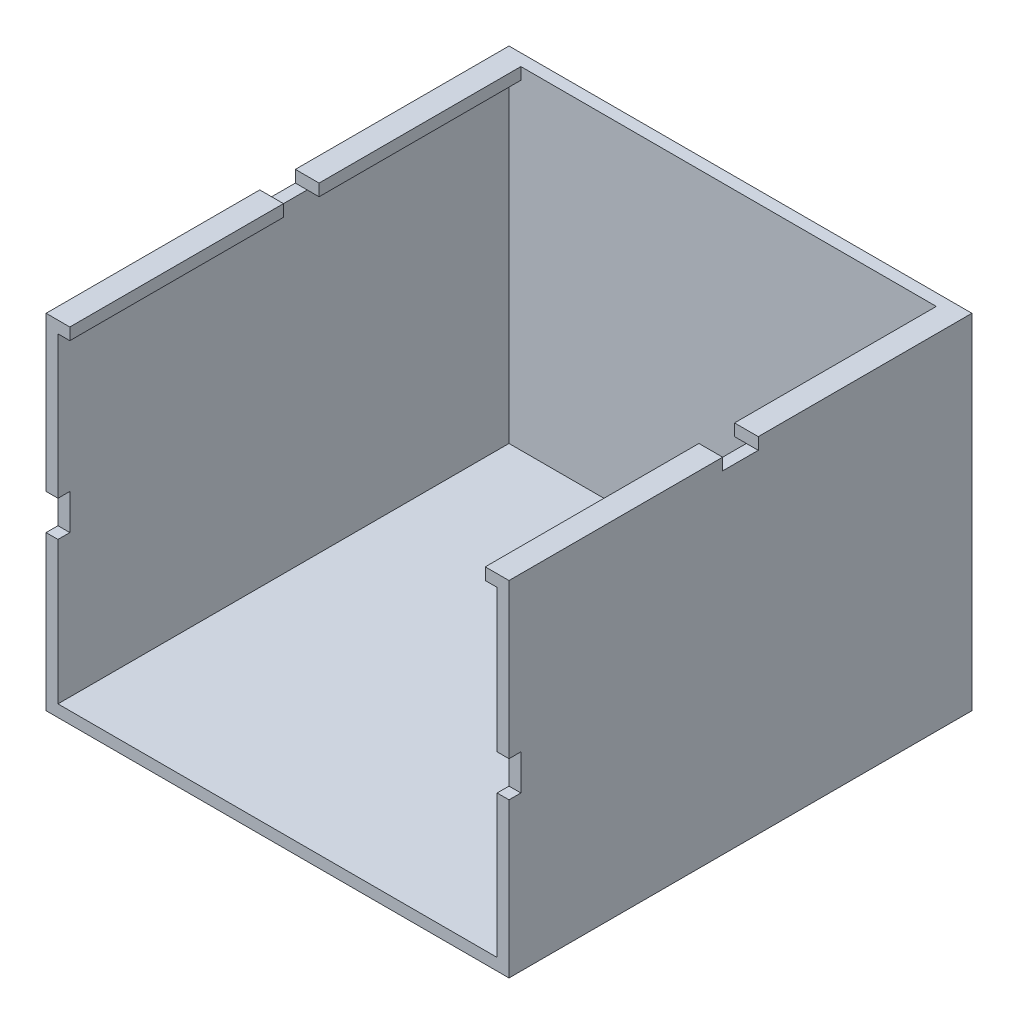
ISO-10303-21;
HEADER;
FILE_DESCRIPTION(('STEP AP214'),'2;1');
FILE_NAME('part.step','',(''),(''),'','','');
FILE_SCHEMA(('AUTOMOTIVE_DESIGN { 1 0 10303 214 1 1 1 1 }'));
ENDSEC;
DATA;
#1=APPLICATION_CONTEXT('core data for automotive mechanical design processes');
#2=APPLICATION_PROTOCOL_DEFINITION('international standard','automotive_design',2000,#1);
#3=PRODUCT_CONTEXT('',#1,'mechanical');
#4=PRODUCT('Part','Part','',(#3));
#5=PRODUCT_RELATED_PRODUCT_CATEGORY('part','',(#4));
#6=PRODUCT_DEFINITION_FORMATION('','',#4);
#7=PRODUCT_DEFINITION_CONTEXT('part definition',#1,'design');
#8=PRODUCT_DEFINITION('design','',#6,#7);
#9=PRODUCT_DEFINITION_SHAPE('','',#8);
#10=(LENGTH_UNIT() NAMED_UNIT(*) SI_UNIT(.MILLI.,.METRE.));
#11=(NAMED_UNIT(*) PLANE_ANGLE_UNIT() SI_UNIT($,.RADIAN.));
#12=(NAMED_UNIT(*) SI_UNIT($,.STERADIAN.) SOLID_ANGLE_UNIT());
#13=UNCERTAINTY_MEASURE_WITH_UNIT(LENGTH_MEASURE(1.E-05),#10,'distance_accuracy_value','');
#14=(GEOMETRIC_REPRESENTATION_CONTEXT(3) GLOBAL_UNCERTAINTY_ASSIGNED_CONTEXT((#13)) GLOBAL_UNIT_ASSIGNED_CONTEXT((#10,
#11,#12)) REPRESENTATION_CONTEXT('',''));
#15=CARTESIAN_POINT('',(0.,0.,0.));
#16=DIRECTION('',(0.,0.,1.));
#17=DIRECTION('',(1.,0.,0.));
#18=AXIS2_PLACEMENT_3D('',#15,#16,#17);
#19=CARTESIAN_POINT('',(15.4272817580175,29.,19.6975655430712));
#20=DIRECTION('',(0.,0.,-1.));
#21=DIRECTION('',(-1.,0.,0.));
#22=AXIS2_PLACEMENT_3D('',#19,#20,#21);
#23=PLANE('',#22);
#24=DIRECTION('',(0.,1.,0.));
#25=VECTOR('',#24,1.);
#26=CARTESIAN_POINT('',(14.4272817580175,28.,19.6975655430712));
#27=LINE('',#26,#25);
#28=CARTESIAN_POINT('',(14.4272817580175,16.,19.6975655430712));
#29=VERTEX_POINT('',#28);
#30=CARTESIAN_POINT('',(14.4272817580175,28.,19.6975655430712));
#31=VERTEX_POINT('',#30);
#32=EDGE_CURVE('E485',#29,#31,#27,.T.);
#33=ORIENTED_EDGE('',*,*,#32,.F.);
#34=DIRECTION('',(-1.,0.,0.));
#35=VECTOR('',#34,1.);
#36=CARTESIAN_POINT('',(-25.3047218498162,16.,19.6975655430712));
#37=LINE('',#36,#35);
#38=CARTESIAN_POINT('',(15.4272817580175,16.,19.6975655430712));
#39=VERTEX_POINT('',#38);
#40=EDGE_CURVE('E339',#39,#29,#37,.T.);
#41=ORIENTED_EDGE('',*,*,#40,.F.);
#42=DIRECTION('',(0.,-1.,0.));
#43=VECTOR('',#42,1.);
#44=CARTESIAN_POINT('',(15.4272817580175,29.,19.6975655430712));
#45=LINE('',#44,#43);
#46=CARTESIAN_POINT('',(15.4272817580175,29.,19.6975655430712));
#47=VERTEX_POINT('',#46);
#48=EDGE_CURVE('E291',#47,#39,#45,.T.);
#49=ORIENTED_EDGE('',*,*,#48,.F.);
#50=DIRECTION('',(1.,0.,0.));
#51=VECTOR('',#50,1.);
#52=CARTESIAN_POINT('',(15.4272817580175,29.,19.6975655430712));
#53=LINE('',#52,#51);
#54=CARTESIAN_POINT('',(13.4272817580175,29.,19.6975655430712));
#55=VERTEX_POINT('',#54);
#56=EDGE_CURVE('E522',#55,#47,#53,.T.);
#57=ORIENTED_EDGE('',*,*,#56,.F.);
#58=DIRECTION('',(0.,-1.,0.));
#59=VECTOR('',#58,1.);
#60=CARTESIAN_POINT('',(13.4272817580175,29.,19.6975655430712));
#61=LINE('',#60,#59);
#62=CARTESIAN_POINT('',(13.4272817580175,28.,19.6975655430712));
#63=VERTEX_POINT('',#62);
#64=EDGE_CURVE('E445',#55,#63,#61,.T.);
#65=ORIENTED_EDGE('',*,*,#64,.T.);
#66=DIRECTION('',(-1.,0.,0.));
#67=VECTOR('',#66,1.);
#68=CARTESIAN_POINT('',(-22.5727182419825,28.,19.6975655430712));
#69=LINE('',#68,#67);
#70=EDGE_CURVE('E463',#31,#63,#69,.T.);
#71=ORIENTED_EDGE('',*,*,#70,.F.);
#72=EDGE_LOOP('',(#33,#41,#49,#57,#65,#71));
#73=FACE_BOUND('',#72,.T.);
#74=ADVANCED_FACE('F62',(#73),#23,.F.);
#75=DIRECTION('',(0.,-1.,0.));
#76=VECTOR('',#75,1.);
#77=CARTESIAN_POINT('',(-23.5727182419825,29.,19.6975655430712));
#78=LINE('',#77,#76);
#79=CARTESIAN_POINT('',(-23.5727182419825,29.,19.6975655430712));
#80=VERTEX_POINT('',#79);
#81=CARTESIAN_POINT('',(-23.5727182419825,16.,19.6975655430712));
#82=VERTEX_POINT('',#81);
#83=EDGE_CURVE('E290',#80,#82,#78,.T.);
#84=ORIENTED_EDGE('',*,*,#83,.T.);
#85=CARTESIAN_POINT('',(-22.5727182419825,16.,19.6975655430712));
#86=VERTEX_POINT('',#85);
#87=EDGE_CURVE('E281',#86,#82,#37,.T.);
#88=ORIENTED_EDGE('',*,*,#87,.F.);
#89=DIRECTION('',(0.,-1.,0.));
#90=VECTOR('',#89,1.);
#91=CARTESIAN_POINT('',(-22.5727182419825,28.,19.6975655430712));
#92=LINE('',#91,#90);
#93=CARTESIAN_POINT('',(-22.5727182419825,28.,19.6975655430712));
#94=VERTEX_POINT('',#93);
#95=EDGE_CURVE('E477',#94,#86,#92,.T.);
#96=ORIENTED_EDGE('',*,*,#95,.F.);
#97=CARTESIAN_POINT('',(-21.5727182419825,28.,19.6975655430712));
#98=VERTEX_POINT('',#97);
#99=EDGE_CURVE('E488',#98,#94,#69,.T.);
#100=ORIENTED_EDGE('',*,*,#99,.F.);
#101=DIRECTION('',(0.,1.,0.));
#102=VECTOR('',#101,1.);
#103=CARTESIAN_POINT('',(-21.5727182419825,29.,19.6975655430712));
#104=LINE('',#103,#102);
#105=CARTESIAN_POINT('',(-21.5727182419825,29.,19.6975655430712));
#106=VERTEX_POINT('',#105);
#107=EDGE_CURVE('E454',#98,#106,#104,.T.);
#108=ORIENTED_EDGE('',*,*,#107,.T.);
#109=EDGE_CURVE('E523',#80,#106,#53,.T.);
#110=ORIENTED_EDGE('',*,*,#109,.F.);
#111=EDGE_LOOP('',(#84,#88,#96,#100,#108,#110));
#112=FACE_BOUND('',#111,.T.);
#113=ADVANCED_FACE('F640',(#112),#23,.F.);
#114=CARTESIAN_POINT('',(-22.5727182419825,28.,-18.3024344569288));
#115=DIRECTION('',(0.,1.,0.));
#116=DIRECTION('',(0.,0.,1.));
#117=AXIS2_PLACEMENT_3D('',#114,#115,#116);
#118=PLANE('',#117);
#119=DIRECTION('',(1.,0.,0.));
#120=VECTOR('',#119,1.);
#121=CARTESIAN_POINT('',(0.,28.,1.69756554307116));
#122=LINE('',#121,#120);
#123=CARTESIAN_POINT('',(-22.5727182419825,28.,1.69756554307116));
#124=VERTEX_POINT('',#123);
#125=CARTESIAN_POINT('',(-21.5727182419825,28.,1.69756554307116));
#126=VERTEX_POINT('',#125);
#127=EDGE_CURVE('E579',#124,#126,#122,.T.);
#128=ORIENTED_EDGE('',*,*,#127,.T.);
#129=DIRECTION('',(0.,0.,1.));
#130=VECTOR('',#129,1.);
#131=CARTESIAN_POINT('',(-21.5727182419825,28.,-18.3024344569288));
#132=LINE('',#131,#130);
#133=EDGE_CURVE('E449',#126,#98,#132,.T.);
#134=ORIENTED_EDGE('',*,*,#133,.T.);
#135=ORIENTED_EDGE('',*,*,#99,.T.);
#136=DIRECTION('',(0.,0.,1.));
#137=VECTOR('',#136,1.);
#138=CARTESIAN_POINT('',(-22.5727182419825,28.,-18.3024344569288));
#139=LINE('',#138,#137);
#140=EDGE_CURVE('E497',#124,#94,#139,.T.);
#141=ORIENTED_EDGE('',*,*,#140,.F.);
#142=EDGE_LOOP('',(#128,#134,#135,#141));
#143=FACE_BOUND('',#142,.T.);
#144=ADVANCED_FACE('F654',(#143),#118,.F.);
#145=CARTESIAN_POINT('',(0.,29.,0.));
#146=DIRECTION('',(0.,1.,0.));
#147=DIRECTION('',(0.,0.,1.));
#148=AXIS2_PLACEMENT_3D('',#145,#146,#147);
#149=PLANE('',#148);
#150=DIRECTION('',(0.,0.,-1.));
#151=VECTOR('',#150,1.);
#152=CARTESIAN_POINT('',(15.4272817580175,29.,19.6975655430712));
#153=LINE('',#152,#151);
#154=CARTESIAN_POINT('',(15.4272817580175,29.,1.69756554307116));
#155=VERTEX_POINT('',#154);
#156=EDGE_CURVE('E509',#47,#155,#153,.T.);
#157=ORIENTED_EDGE('',*,*,#156,.T.);
#158=DIRECTION('',(-1.,0.,0.));
#159=VECTOR('',#158,1.);
#160=CARTESIAN_POINT('',(0.,29.,1.69756554307116));
#161=LINE('',#160,#159);
#162=CARTESIAN_POINT('',(13.4272817580175,29.,1.69756554307116));
#163=VERTEX_POINT('',#162);
#164=EDGE_CURVE('E377',#155,#163,#161,.T.);
#165=ORIENTED_EDGE('',*,*,#164,.T.);
#166=DIRECTION('',(0.,0.,-1.));
#167=VECTOR('',#166,1.);
#168=CARTESIAN_POINT('',(13.4272817580175,29.,-18.3024344569288));
#169=LINE('',#168,#167);
#170=EDGE_CURVE('E425',#55,#163,#169,.T.);
#171=ORIENTED_EDGE('',*,*,#170,.F.);
#172=ORIENTED_EDGE('',*,*,#56,.T.);
#173=EDGE_LOOP('',(#157,#165,#171,#172));
#174=FACE_BOUND('',#173,.T.);
#175=ADVANCED_FACE('F694',(#174),#149,.T.);
#176=DIRECTION('',(0.,0.,1.));
#177=VECTOR('',#176,1.);
#178=CARTESIAN_POINT('',(-21.5727182419825,29.,-18.3024344569288));
#179=LINE('',#178,#177);
#180=CARTESIAN_POINT('',(-21.5727182419825,29.,1.69756554307116));
#181=VERTEX_POINT('',#180);
#182=EDGE_CURVE('E419',#181,#106,#179,.T.);
#183=ORIENTED_EDGE('',*,*,#182,.F.);
#184=CARTESIAN_POINT('',(-23.5727182419825,29.,1.69756554307116));
#185=VERTEX_POINT('',#184);
#186=EDGE_CURVE('E382',#181,#185,#161,.T.);
#187=ORIENTED_EDGE('',*,*,#186,.T.);
#188=DIRECTION('',(0.,0.,1.));
#189=VECTOR('',#188,1.);
#190=CARTESIAN_POINT('',(-23.5727182419825,29.,19.6975655430712));
#191=LINE('',#190,#189);
#192=EDGE_CURVE('E517',#185,#80,#191,.T.);
#193=ORIENTED_EDGE('',*,*,#192,.T.);
#194=ORIENTED_EDGE('',*,*,#109,.T.);
#195=EDGE_LOOP('',(#183,#187,#193,#194));
#196=FACE_BOUND('',#195,.T.);
#197=ADVANCED_FACE('F635',(#196),#149,.T.);
#198=CARTESIAN_POINT('',(13.4272817580175,28.,1.69756554307116));
#199=VERTEX_POINT('',#198);
#200=CARTESIAN_POINT('',(14.4272817580175,28.,1.69756554307116));
#201=VERTEX_POINT('',#200);
#202=EDGE_CURVE('E369',#199,#201,#122,.T.);
#203=ORIENTED_EDGE('',*,*,#202,.T.);
#204=DIRECTION('',(0.,0.,1.));
#205=VECTOR('',#204,1.);
#206=CARTESIAN_POINT('',(14.4272817580175,28.,-18.3024344569288));
#207=LINE('',#206,#205);
#208=EDGE_CURVE('E502',#201,#31,#207,.T.);
#209=ORIENTED_EDGE('',*,*,#208,.T.);
#210=ORIENTED_EDGE('',*,*,#70,.T.);
#211=DIRECTION('',(0.,0.,-1.));
#212=VECTOR('',#211,1.);
#213=CARTESIAN_POINT('',(13.4272817580175,28.,-18.3024344569288));
#214=LINE('',#213,#212);
#215=EDGE_CURVE('E441',#63,#199,#214,.T.);
#216=ORIENTED_EDGE('',*,*,#215,.T.);
#217=EDGE_LOOP('',(#203,#209,#210,#216));
#218=FACE_BOUND('',#217,.T.);
#219=ADVANCED_FACE('F621',(#218),#118,.F.);
#220=CARTESIAN_POINT('',(-21.5727182419825,19.,-18.3024344569288));
#221=DIRECTION('',(-1.,0.,0.));
#222=DIRECTION('',(0.,0.,1.));
#223=AXIS2_PLACEMENT_3D('',#220,#221,#222);
#224=PLANE('',#223);
#225=DIRECTION('',(0.,-1.,0.));
#226=VECTOR('',#225,1.);
#227=CARTESIAN_POINT('',(-21.5727182419825,19.,1.69756554307116));
#228=LINE('',#227,#226);
#229=EDGE_CURVE('E385',#181,#126,#228,.T.);
#230=ORIENTED_EDGE('',*,*,#229,.F.);
#231=ORIENTED_EDGE('',*,*,#182,.T.);
#232=ORIENTED_EDGE('',*,*,#107,.F.);
#233=ORIENTED_EDGE('',*,*,#133,.F.);
#234=EDGE_LOOP('',(#230,#231,#232,#233));
#235=FACE_BOUND('',#234,.T.);
#236=ADVANCED_FACE('F648',(#235),#224,.F.);
#237=CARTESIAN_POINT('',(13.4272817580175,19.,-18.3024344569288));
#238=DIRECTION('',(1.,0.,0.));
#239=DIRECTION('',(0.,0.,-1.));
#240=AXIS2_PLACEMENT_3D('',#237,#238,#239);
#241=PLANE('',#240);
#242=DIRECTION('',(0.,1.,0.));
#243=VECTOR('',#242,1.);
#244=CARTESIAN_POINT('',(13.4272817580175,19.,1.69756554307116));
#245=LINE('',#244,#243);
#246=EDGE_CURVE('E308',#199,#163,#245,.T.);
#247=ORIENTED_EDGE('',*,*,#246,.F.);
#248=ORIENTED_EDGE('',*,*,#215,.F.);
#249=ORIENTED_EDGE('',*,*,#64,.F.);
#250=ORIENTED_EDGE('',*,*,#170,.T.);
#251=EDGE_LOOP('',(#247,#248,#249,#250));
#252=FACE_BOUND('',#251,.T.);
#253=ADVANCED_FACE('F623',(#252),#241,.F.);
#254=CARTESIAN_POINT('',(-21.5727182419825,28.,-18.3024344569288));
#255=VERTEX_POINT('',#254);
#256=CARTESIAN_POINT('',(-21.5727182419825,28.,-1.30243445692884));
#257=VERTEX_POINT('',#256);
#258=EDGE_CURVE('E450',#255,#257,#132,.T.);
#259=ORIENTED_EDGE('',*,*,#258,.T.);
#260=DIRECTION('',(1.,0.,0.));
#261=VECTOR('',#260,1.);
#262=CARTESIAN_POINT('',(0.,28.,-1.30243445692884));
#263=LINE('',#262,#261);
#264=CARTESIAN_POINT('',(-22.5727182419825,28.,-1.30243445692884));
#265=VERTEX_POINT('',#264);
#266=EDGE_CURVE('E573',#265,#257,#263,.T.);
#267=ORIENTED_EDGE('',*,*,#266,.F.);
#268=CARTESIAN_POINT('',(-22.5727182419825,28.,-18.3024344569288));
#269=VERTEX_POINT('',#268);
#270=EDGE_CURVE('E492',#269,#265,#139,.T.);
#271=ORIENTED_EDGE('',*,*,#270,.F.);
#272=DIRECTION('',(-1.,0.,0.));
#273=VECTOR('',#272,1.);
#274=CARTESIAN_POINT('',(-22.5727182419825,28.,-18.3024344569288));
#275=LINE('',#274,#273);
#276=EDGE_CURVE('E471',#255,#269,#275,.T.);
#277=ORIENTED_EDGE('',*,*,#276,.F.);
#278=EDGE_LOOP('',(#259,#267,#271,#277));
#279=FACE_BOUND('',#278,.T.);
#280=ADVANCED_FACE('F667',(#279),#118,.F.);
#281=CARTESIAN_POINT('',(15.4272817580175,29.,19.6975655430712));
#282=DIRECTION('',(-1.,0.,0.));
#283=DIRECTION('',(0.,0.,1.));
#284=AXIS2_PLACEMENT_3D('',#281,#282,#283);
#285=PLANE('',#284);
#286=ORIENTED_EDGE('',*,*,#48,.T.);
#287=DIRECTION('',(0.,0.,-1.));
#288=VECTOR('',#287,1.);
#289=CARTESIAN_POINT('',(15.4272817580175,16.,19.6975655430712));
#290=LINE('',#289,#288);
#291=CARTESIAN_POINT('',(15.4272817580175,16.,18.6975655430712));
#292=VERTEX_POINT('',#291);
#293=EDGE_CURVE('E361',#39,#292,#290,.T.);
#294=ORIENTED_EDGE('',*,*,#293,.T.);
#295=DIRECTION('',(0.,1.,0.));
#296=VECTOR('',#295,1.);
#297=CARTESIAN_POINT('',(15.4272817580175,29.,18.6975655430712));
#298=LINE('',#297,#296);
#299=CARTESIAN_POINT('',(15.4272817580175,13.,18.6975655430712));
#300=VERTEX_POINT('',#299);
#301=EDGE_CURVE('E346',#300,#292,#298,.T.);
#302=ORIENTED_EDGE('',*,*,#301,.F.);
#303=DIRECTION('',(0.,0.,1.));
#304=VECTOR('',#303,1.);
#305=CARTESIAN_POINT('',(15.4272817580175,13.,19.6975655430712));
#306=LINE('',#305,#304);
#307=CARTESIAN_POINT('',(15.4272817580175,13.,19.6975655430712));
#308=VERTEX_POINT('',#307);
#309=EDGE_CURVE('E268',#300,#308,#306,.T.);
#310=ORIENTED_EDGE('',*,*,#309,.T.);
#311=CARTESIAN_POINT('',(15.4272817580175,0.,19.6975655430712));
#312=VERTEX_POINT('',#311);
#313=EDGE_CURVE('E298',#308,#312,#45,.T.);
#314=ORIENTED_EDGE('',*,*,#313,.T.);
#315=DIRECTION('',(0.,0.,-1.));
#316=VECTOR('',#315,1.);
#317=CARTESIAN_POINT('',(15.4272817580175,0.,19.6975655430712));
#318=LINE('',#317,#316);
#319=CARTESIAN_POINT('',(15.4272817580175,0.,-19.3024344569288));
#320=VERTEX_POINT('',#319);
#321=EDGE_CURVE('E496',#312,#320,#318,.T.);
#322=ORIENTED_EDGE('',*,*,#321,.T.);
#323=DIRECTION('',(0.,-1.,0.));
#324=VECTOR('',#323,1.);
#325=CARTESIAN_POINT('',(15.4272817580175,29.,-19.3024344569288));
#326=LINE('',#325,#324);
#327=CARTESIAN_POINT('',(15.4272817580175,29.,-19.3024344569288));
#328=VERTEX_POINT('',#327);
#329=EDGE_CURVE('E304',#328,#320,#326,.T.);
#330=ORIENTED_EDGE('',*,*,#329,.F.);
#331=CARTESIAN_POINT('',(15.4272817580175,29.,-1.30243445692884));
#332=VERTEX_POINT('',#331);
#333=EDGE_CURVE('E514',#332,#328,#153,.T.);
#334=ORIENTED_EDGE('',*,*,#333,.F.);
#335=DIRECTION('',(0.,-1.,0.));
#336=VECTOR('',#335,1.);
#337=CARTESIAN_POINT('',(15.4272817580175,29.,-1.30243445692884));
#338=LINE('',#337,#336);
#339=CARTESIAN_POINT('',(15.4272817580175,28.,-1.30243445692884));
#340=VERTEX_POINT('',#339);
#341=EDGE_CURVE('E406',#332,#340,#338,.T.);
#342=ORIENTED_EDGE('',*,*,#341,.T.);
#343=DIRECTION('',(0.,0.,-1.));
#344=VECTOR('',#343,1.);
#345=CARTESIAN_POINT('',(15.4272817580175,28.,19.6975655430712));
#346=LINE('',#345,#344);
#347=CARTESIAN_POINT('',(15.4272817580175,28.,1.69756554307116));
#348=VERTEX_POINT('',#347);
#349=EDGE_CURVE('E400',#348,#340,#346,.T.);
#350=ORIENTED_EDGE('',*,*,#349,.F.);
#351=DIRECTION('',(0.,-1.,0.));
#352=VECTOR('',#351,1.);
#353=CARTESIAN_POINT('',(15.4272817580175,29.,1.69756554307116));
#354=LINE('',#353,#352);
#355=EDGE_CURVE('E381',#155,#348,#354,.T.);
#356=ORIENTED_EDGE('',*,*,#355,.F.);
#357=ORIENTED_EDGE('',*,*,#156,.F.);
#358=EDGE_LOOP('',(#286,#294,#302,#310,#314,#322,#330,#334,#342,#350,#356,#357));
#359=FACE_BOUND('',#358,.T.);
#360=ADVANCED_FACE('F64',(#359),#285,.F.);
#361=CARTESIAN_POINT('',(15.4272817580175,29.,-19.3024344569288));
#362=DIRECTION('',(0.,0.,1.));
#363=DIRECTION('',(1.,0.,0.));
#364=AXIS2_PLACEMENT_3D('',#361,#362,#363);
#365=PLANE('',#364);
#366=DIRECTION('',(-1.,0.,0.));
#367=VECTOR('',#366,1.);
#368=CARTESIAN_POINT('',(15.4272817580175,0.,-19.3024344569288));
#369=LINE('',#368,#367);
#370=CARTESIAN_POINT('',(-23.5727182419825,0.,-19.3024344569288));
#371=VERTEX_POINT('',#370);
#372=EDGE_CURVE('E530',#320,#371,#369,.T.);
#373=ORIENTED_EDGE('',*,*,#372,.T.);
#374=DIRECTION('',(0.,-1.,0.));
#375=VECTOR('',#374,1.);
#376=CARTESIAN_POINT('',(-23.5727182419825,29.,-19.3024344569288));
#377=LINE('',#376,#375);
#378=CARTESIAN_POINT('',(-23.5727182419825,29.,-19.3024344569288));
#379=VERTEX_POINT('',#378);
#380=EDGE_CURVE('E296',#379,#371,#377,.T.);
#381=ORIENTED_EDGE('',*,*,#380,.F.);
#382=DIRECTION('',(-1.,0.,0.));
#383=VECTOR('',#382,1.);
#384=CARTESIAN_POINT('',(15.4272817580175,29.,-19.3024344569288));
#385=LINE('',#384,#383);
#386=EDGE_CURVE('E513',#328,#379,#385,.T.);
#387=ORIENTED_EDGE('',*,*,#386,.F.);
#388=ORIENTED_EDGE('',*,*,#329,.T.);
#389=EDGE_LOOP('',(#373,#381,#387,#388));
#390=FACE_BOUND('',#389,.T.);
#391=ADVANCED_FACE('F548',(#390),#365,.F.);
#392=CARTESIAN_POINT('',(-23.5727182419825,29.,19.6975655430712));
#393=DIRECTION('',(1.,0.,0.));
#394=DIRECTION('',(0.,0.,-1.));
#395=AXIS2_PLACEMENT_3D('',#392,#393,#394);
#396=PLANE('',#395);
#397=DIRECTION('',(0.,-1.,0.));
#398=VECTOR('',#397,1.);
#399=CARTESIAN_POINT('',(-23.5727182419825,29.,18.6975655430712));
#400=LINE('',#399,#398);
#401=CARTESIAN_POINT('',(-23.5727182419825,16.,18.6975655430712));
#402=VERTEX_POINT('',#401);
#403=CARTESIAN_POINT('',(-23.5727182419825,13.,18.6975655430712));
#404=VERTEX_POINT('',#403);
#405=EDGE_CURVE('E343',#402,#404,#400,.T.);
#406=ORIENTED_EDGE('',*,*,#405,.F.);
#407=DIRECTION('',(0.,0.,1.));
#408=VECTOR('',#407,1.);
#409=CARTESIAN_POINT('',(-23.5727182419825,16.,19.6975655430712));
#410=LINE('',#409,#408);
#411=EDGE_CURVE('E357',#402,#82,#410,.T.);
#412=ORIENTED_EDGE('',*,*,#411,.T.);
#413=ORIENTED_EDGE('',*,*,#83,.F.);
#414=ORIENTED_EDGE('',*,*,#192,.F.);
#415=DIRECTION('',(0.,1.,0.));
#416=VECTOR('',#415,1.);
#417=CARTESIAN_POINT('',(-23.5727182419825,29.,1.69756554307116));
#418=LINE('',#417,#416);
#419=CARTESIAN_POINT('',(-23.5727182419825,28.,1.69756554307116));
#420=VERTEX_POINT('',#419);
#421=EDGE_CURVE('E388',#420,#185,#418,.T.);
#422=ORIENTED_EDGE('',*,*,#421,.F.);
#423=DIRECTION('',(0.,0.,1.));
#424=VECTOR('',#423,1.);
#425=CARTESIAN_POINT('',(-23.5727182419825,28.,19.6975655430712));
#426=LINE('',#425,#424);
#427=CARTESIAN_POINT('',(-23.5727182419825,28.,-1.30243445692884));
#428=VERTEX_POINT('',#427);
#429=EDGE_CURVE('E397',#428,#420,#426,.T.);
#430=ORIENTED_EDGE('',*,*,#429,.F.);
#431=DIRECTION('',(0.,1.,0.));
#432=VECTOR('',#431,1.);
#433=CARTESIAN_POINT('',(-23.5727182419825,29.,-1.30243445692884));
#434=LINE('',#433,#432);
#435=CARTESIAN_POINT('',(-23.5727182419825,29.,-1.30243445692884));
#436=VERTEX_POINT('',#435);
#437=EDGE_CURVE('E415',#428,#436,#434,.T.);
#438=ORIENTED_EDGE('',*,*,#437,.T.);
#439=EDGE_CURVE('E518',#379,#436,#191,.T.);
#440=ORIENTED_EDGE('',*,*,#439,.F.);
#441=ORIENTED_EDGE('',*,*,#380,.T.);
#442=DIRECTION('',(0.,0.,1.));
#443=VECTOR('',#442,1.);
#444=CARTESIAN_POINT('',(-23.5727182419825,0.,19.6975655430712));
#445=LINE('',#444,#443);
#446=CARTESIAN_POINT('',(-23.5727182419825,0.,19.6975655430712));
#447=VERTEX_POINT('',#446);
#448=EDGE_CURVE('E287',#371,#447,#445,.T.);
#449=ORIENTED_EDGE('',*,*,#448,.T.);
#450=CARTESIAN_POINT('',(-23.5727182419825,13.,19.6975655430712));
#451=VERTEX_POINT('',#450);
#452=EDGE_CURVE('E276',#451,#447,#78,.T.);
#453=ORIENTED_EDGE('',*,*,#452,.F.);
#454=DIRECTION('',(0.,0.,-1.));
#455=VECTOR('',#454,1.);
#456=CARTESIAN_POINT('',(-23.5727182419825,13.,19.6975655430712));
#457=LINE('',#456,#455);
#458=EDGE_CURVE('E259',#451,#404,#457,.T.);
#459=ORIENTED_EDGE('',*,*,#458,.T.);
#460=EDGE_LOOP('',(#406,#412,#413,#414,#422,#430,#438,#440,#441,#449,#453,#459));
#461=FACE_BOUND('',#460,.T.);
#462=ADVANCED_FACE('F284',(#461),#396,.F.);
#463=ORIENTED_EDGE('',*,*,#313,.F.);
#464=DIRECTION('',(1.,0.,0.));
#465=VECTOR('',#464,1.);
#466=CARTESIAN_POINT('',(-25.3047218498162,13.,19.6975655430712));
#467=LINE('',#466,#465);
#468=CARTESIAN_POINT('',(14.4272817580175,13.,19.6975655430712));
#469=VERTEX_POINT('',#468);
#470=EDGE_CURVE('E282',#469,#308,#467,.T.);
#471=ORIENTED_EDGE('',*,*,#470,.F.);
#472=CARTESIAN_POINT('',(14.4272817580175,1.,19.6975655430712));
#473=VERTEX_POINT('',#472);
#474=EDGE_CURVE('E324',#473,#469,#27,.T.);
#475=ORIENTED_EDGE('',*,*,#474,.F.);
#476=DIRECTION('',(1.,0.,0.));
#477=VECTOR('',#476,1.);
#478=CARTESIAN_POINT('',(-22.5727182419825,1.,19.6975655430712));
#479=LINE('',#478,#477);
#480=CARTESIAN_POINT('',(-22.5727182419825,1.,19.6975655430712));
#481=VERTEX_POINT('',#480);
#482=EDGE_CURVE('E481',#481,#473,#479,.T.);
#483=ORIENTED_EDGE('',*,*,#482,.F.);
#484=CARTESIAN_POINT('',(-22.5727182419825,13.,19.6975655430712));
#485=VERTEX_POINT('',#484);
#486=EDGE_CURVE('E279',#485,#481,#92,.T.);
#487=ORIENTED_EDGE('',*,*,#486,.F.);
#488=EDGE_CURVE('E262',#451,#485,#467,.T.);
#489=ORIENTED_EDGE('',*,*,#488,.F.);
#490=ORIENTED_EDGE('',*,*,#452,.T.);
#491=DIRECTION('',(1.,0.,0.));
#492=VECTOR('',#491,1.);
#493=CARTESIAN_POINT('',(15.4272817580175,0.,19.6975655430712));
#494=LINE('',#493,#492);
#495=EDGE_CURVE('E534',#447,#312,#494,.T.);
#496=ORIENTED_EDGE('',*,*,#495,.T.);
#497=EDGE_LOOP('',(#463,#471,#475,#483,#487,#489,#490,#496));
#498=FACE_BOUND('',#497,.T.);
#499=ADVANCED_FACE('F274',(#498),#23,.F.);
#500=DIRECTION('',(-1.,0.,0.));
#501=VECTOR('',#500,1.);
#502=CARTESIAN_POINT('',(0.,29.,-1.30243445692884));
#503=LINE('',#502,#501);
#504=CARTESIAN_POINT('',(13.4272817580175,29.,-1.30243445692884));
#505=VERTEX_POINT('',#504);
#506=EDGE_CURVE('E403',#332,#505,#503,.T.);
#507=ORIENTED_EDGE('',*,*,#506,.F.);
#508=ORIENTED_EDGE('',*,*,#333,.T.);
#509=ORIENTED_EDGE('',*,*,#386,.T.);
#510=ORIENTED_EDGE('',*,*,#439,.T.);
#511=CARTESIAN_POINT('',(-21.5727182419825,29.,-1.30243445692884));
#512=VERTEX_POINT('',#511);
#513=EDGE_CURVE('E407',#512,#436,#503,.T.);
#514=ORIENTED_EDGE('',*,*,#513,.F.);
#515=CARTESIAN_POINT('',(-21.5727182419825,29.,-18.3024344569288));
#516=VERTEX_POINT('',#515);
#517=EDGE_CURVE('E420',#516,#512,#179,.T.);
#518=ORIENTED_EDGE('',*,*,#517,.F.);
#519=DIRECTION('',(-1.,0.,0.));
#520=VECTOR('',#519,1.);
#521=CARTESIAN_POINT('',(-21.5727182419825,29.,-18.3024344569288));
#522=LINE('',#521,#520);
#523=CARTESIAN_POINT('',(13.4272817580175,29.,-18.3024344569288));
#524=VERTEX_POINT('',#523);
#525=EDGE_CURVE('E429',#524,#516,#522,.T.);
#526=ORIENTED_EDGE('',*,*,#525,.F.);
#527=EDGE_CURVE('E424',#505,#524,#169,.T.);
#528=ORIENTED_EDGE('',*,*,#527,.F.);
#529=EDGE_LOOP('',(#507,#508,#509,#510,#514,#518,#526,#528));
#530=FACE_BOUND('',#529,.T.);
#531=ADVANCED_FACE('F542',(#530),#149,.T.);
#532=CARTESIAN_POINT('',(0.,0.,0.));
#533=DIRECTION('',(0.,1.,0.));
#534=DIRECTION('',(0.,0.,1.));
#535=AXIS2_PLACEMENT_3D('',#532,#533,#534);
#536=PLANE('',#535);
#537=ORIENTED_EDGE('',*,*,#321,.F.);
#538=ORIENTED_EDGE('',*,*,#495,.F.);
#539=ORIENTED_EDGE('',*,*,#448,.F.);
#540=ORIENTED_EDGE('',*,*,#372,.F.);
#541=EDGE_LOOP('',(#537,#538,#539,#540));
#542=FACE_BOUND('',#541,.T.);
#543=ADVANCED_FACE('F551',(#542),#536,.F.);
#544=CARTESIAN_POINT('',(-22.5727182419825,28.,-18.3024344569288));
#545=DIRECTION('',(-1.,0.,0.));
#546=DIRECTION('',(0.,-1.,0.));
#547=AXIS2_PLACEMENT_3D('',#544,#545,#546);
#548=PLANE('',#547);
#549=ORIENTED_EDGE('',*,*,#95,.T.);
#550=DIRECTION('',(0.,0.,-1.));
#551=VECTOR('',#550,1.);
#552=CARTESIAN_POINT('',(-22.5727182419825,16.,-18.3024344569288));
#553=LINE('',#552,#551);
#554=CARTESIAN_POINT('',(-22.5727182419825,16.,18.6975655430712));
#555=VERTEX_POINT('',#554);
#556=EDGE_CURVE('E353',#86,#555,#553,.T.);
#557=ORIENTED_EDGE('',*,*,#556,.T.);
#558=DIRECTION('',(0.,1.,0.));
#559=VECTOR('',#558,1.);
#560=CARTESIAN_POINT('',(-22.5727182419825,28.,18.6975655430712));
#561=LINE('',#560,#559);
#562=CARTESIAN_POINT('',(-22.5727182419825,13.,18.6975655430712));
#563=VERTEX_POINT('',#562);
#564=EDGE_CURVE('E340',#563,#555,#561,.T.);
#565=ORIENTED_EDGE('',*,*,#564,.F.);
#566=DIRECTION('',(0.,0.,1.));
#567=VECTOR('',#566,1.);
#568=CARTESIAN_POINT('',(-22.5727182419825,13.,-18.3024344569288));
#569=LINE('',#568,#567);
#570=EDGE_CURVE('E269',#563,#485,#569,.T.);
#571=ORIENTED_EDGE('',*,*,#570,.T.);
#572=ORIENTED_EDGE('',*,*,#486,.T.);
#573=DIRECTION('',(0.,0.,1.));
#574=VECTOR('',#573,1.);
#575=CARTESIAN_POINT('',(-22.5727182419825,1.,-18.3024344569288));
#576=LINE('',#575,#574);
#577=CARTESIAN_POINT('',(-22.5727182419825,1.,-18.3024344569288));
#578=VERTEX_POINT('',#577);
#579=EDGE_CURVE('E476',#578,#481,#576,.T.);
#580=ORIENTED_EDGE('',*,*,#579,.F.);
#581=DIRECTION('',(0.,-1.,0.));
#582=VECTOR('',#581,1.);
#583=CARTESIAN_POINT('',(-22.5727182419825,28.,-18.3024344569288));
#584=LINE('',#583,#582);
#585=EDGE_CURVE('E458',#269,#578,#584,.T.);
#586=ORIENTED_EDGE('',*,*,#585,.F.);
#587=ORIENTED_EDGE('',*,*,#270,.T.);
#588=DIRECTION('',(0.,0.,-1.));
#589=VECTOR('',#588,1.);
#590=CARTESIAN_POINT('',(-22.5727182419825,28.,-18.3024344569288));
#591=LINE('',#590,#589);
#592=EDGE_CURVE('E394',#124,#265,#591,.T.);
#593=ORIENTED_EDGE('',*,*,#592,.F.);
#594=ORIENTED_EDGE('',*,*,#140,.T.);
#595=EDGE_LOOP('',(#549,#557,#565,#571,#572,#580,#586,#587,#593,#594));
#596=FACE_BOUND('',#595,.T.);
#597=ADVANCED_FACE('F658',(#596),#548,.F.);
#598=CARTESIAN_POINT('',(14.4272817580175,28.,-18.3024344569288));
#599=VERTEX_POINT('',#598);
#600=CARTESIAN_POINT('',(14.4272817580175,28.,-1.30243445692884));
#601=VERTEX_POINT('',#600);
#602=EDGE_CURVE('E498',#599,#601,#207,.T.);
#603=ORIENTED_EDGE('',*,*,#602,.T.);
#604=CARTESIAN_POINT('',(13.4272817580175,28.,-1.30243445692884));
#605=VERTEX_POINT('',#604);
#606=EDGE_CURVE('E375',#605,#601,#263,.T.);
#607=ORIENTED_EDGE('',*,*,#606,.F.);
#608=CARTESIAN_POINT('',(13.4272817580175,28.,-18.3024344569288));
#609=VERTEX_POINT('',#608);
#610=EDGE_CURVE('E437',#605,#609,#214,.T.);
#611=ORIENTED_EDGE('',*,*,#610,.T.);
#612=EDGE_CURVE('E472',#599,#609,#275,.T.);
#613=ORIENTED_EDGE('',*,*,#612,.F.);
#614=EDGE_LOOP('',(#603,#607,#611,#613));
#615=FACE_BOUND('',#614,.T.);
#616=ADVANCED_FACE('F607',(#615),#118,.F.);
#617=CARTESIAN_POINT('',(14.4272817580175,28.,-18.3024344569288));
#618=DIRECTION('',(1.,0.,0.));
#619=DIRECTION('',(0.,0.,-1.));
#620=AXIS2_PLACEMENT_3D('',#617,#618,#619);
#621=PLANE('',#620);
#622=DIRECTION('',(0.,-1.,0.));
#623=VECTOR('',#622,1.);
#624=CARTESIAN_POINT('',(14.4272817580175,28.,18.6975655430712));
#625=LINE('',#624,#623);
#626=CARTESIAN_POINT('',(14.4272817580175,16.,18.6975655430712));
#627=VERTEX_POINT('',#626);
#628=CARTESIAN_POINT('',(14.4272817580175,13.,18.6975655430712));
#629=VERTEX_POINT('',#628);
#630=EDGE_CURVE('E315',#627,#629,#625,.T.);
#631=ORIENTED_EDGE('',*,*,#630,.F.);
#632=DIRECTION('',(0.,0.,1.));
#633=VECTOR('',#632,1.);
#634=CARTESIAN_POINT('',(14.4272817580175,16.,-18.3024344569288));
#635=LINE('',#634,#633);
#636=EDGE_CURVE('E12',#627,#29,#635,.T.);
#637=ORIENTED_EDGE('',*,*,#636,.T.);
#638=ORIENTED_EDGE('',*,*,#32,.T.);
#639=ORIENTED_EDGE('',*,*,#208,.F.);
#640=DIRECTION('',(0.,0.,1.));
#641=VECTOR('',#640,1.);
#642=CARTESIAN_POINT('',(14.4272817580175,28.,-18.3024344569288));
#643=LINE('',#642,#641);
#644=EDGE_CURVE('E391',#601,#201,#643,.T.);
#645=ORIENTED_EDGE('',*,*,#644,.F.);
#646=ORIENTED_EDGE('',*,*,#602,.F.);
#647=DIRECTION('',(0.,1.,0.));
#648=VECTOR('',#647,1.);
#649=CARTESIAN_POINT('',(14.4272817580175,28.,-18.3024344569288));
#650=LINE('',#649,#648);
#651=CARTESIAN_POINT('',(14.4272817580175,1.,-18.3024344569288));
#652=VERTEX_POINT('',#651);
#653=EDGE_CURVE('E467',#652,#599,#650,.T.);
#654=ORIENTED_EDGE('',*,*,#653,.F.);
#655=DIRECTION('',(0.,0.,1.));
#656=VECTOR('',#655,1.);
#657=CARTESIAN_POINT('',(14.4272817580175,1.,-18.3024344569288));
#658=LINE('',#657,#656);
#659=EDGE_CURVE('E503',#652,#473,#658,.T.);
#660=ORIENTED_EDGE('',*,*,#659,.T.);
#661=ORIENTED_EDGE('',*,*,#474,.T.);
#662=DIRECTION('',(0.,0.,-1.));
#663=VECTOR('',#662,1.);
#664=CARTESIAN_POINT('',(14.4272817580175,13.,-18.3024344569288));
#665=LINE('',#664,#663);
#666=EDGE_CURVE('E71',#469,#629,#665,.T.);
#667=ORIENTED_EDGE('',*,*,#666,.T.);
#668=EDGE_LOOP('',(#631,#637,#638,#639,#645,#646,#654,#660,#661,#667));
#669=FACE_BOUND('',#668,.T.);
#670=ADVANCED_FACE('F322',(#669),#621,.F.);
#671=CARTESIAN_POINT('',(-22.5727182419825,1.,-18.3024344569288));
#672=DIRECTION('',(0.,-1.,0.));
#673=DIRECTION('',(0.,0.,-1.));
#674=AXIS2_PLACEMENT_3D('',#671,#672,#673);
#675=PLANE('',#674);
#676=ORIENTED_EDGE('',*,*,#482,.T.);
#677=ORIENTED_EDGE('',*,*,#659,.F.);
#678=DIRECTION('',(1.,0.,0.));
#679=VECTOR('',#678,1.);
#680=CARTESIAN_POINT('',(-22.5727182419825,1.,-18.3024344569288));
#681=LINE('',#680,#679);
#682=EDGE_CURVE('E462',#578,#652,#681,.T.);
#683=ORIENTED_EDGE('',*,*,#682,.F.);
#684=ORIENTED_EDGE('',*,*,#579,.T.);
#685=EDGE_LOOP('',(#676,#677,#683,#684));
#686=FACE_BOUND('',#685,.T.);
#687=ADVANCED_FACE('F671',(#686),#675,.F.);
#688=CARTESIAN_POINT('',(0.,0.,-18.3024344569288));
#689=DIRECTION('',(0.,0.,1.));
#690=DIRECTION('',(1.,0.,0.));
#691=AXIS2_PLACEMENT_3D('',#688,#689,#690);
#692=PLANE('',#691);
#693=ORIENTED_EDGE('',*,*,#612,.T.);
#694=DIRECTION('',(0.,1.,0.));
#695=VECTOR('',#694,1.);
#696=CARTESIAN_POINT('',(13.4272817580175,19.,-18.3024344569288));
#697=LINE('',#696,#695);
#698=EDGE_CURVE('E433',#609,#524,#697,.T.);
#699=ORIENTED_EDGE('',*,*,#698,.T.);
#700=ORIENTED_EDGE('',*,*,#525,.T.);
#701=DIRECTION('',(0.,1.,0.));
#702=VECTOR('',#701,1.);
#703=CARTESIAN_POINT('',(-21.5727182419825,19.,-18.3024344569288));
#704=LINE('',#703,#702);
#705=EDGE_CURVE('E434',#255,#516,#704,.T.);
#706=ORIENTED_EDGE('',*,*,#705,.F.);
#707=ORIENTED_EDGE('',*,*,#276,.T.);
#708=ORIENTED_EDGE('',*,*,#585,.T.);
#709=ORIENTED_EDGE('',*,*,#682,.T.);
#710=ORIENTED_EDGE('',*,*,#653,.T.);
#711=EDGE_LOOP('',(#693,#699,#700,#706,#707,#708,#709,#710));
#712=FACE_BOUND('',#711,.T.);
#713=ADVANCED_FACE('F563',(#712),#692,.T.);
#714=ORIENTED_EDGE('',*,*,#517,.T.);
#715=DIRECTION('',(0.,-1.,0.));
#716=VECTOR('',#715,1.);
#717=CARTESIAN_POINT('',(-21.5727182419825,19.,-1.30243445692884));
#718=LINE('',#717,#716);
#719=EDGE_CURVE('E411',#512,#257,#718,.T.);
#720=ORIENTED_EDGE('',*,*,#719,.T.);
#721=ORIENTED_EDGE('',*,*,#258,.F.);
#722=ORIENTED_EDGE('',*,*,#705,.T.);
#723=EDGE_LOOP('',(#714,#720,#721,#722));
#724=FACE_BOUND('',#723,.T.);
#725=ADVANCED_FACE('F559',(#724),#224,.F.);
#726=ORIENTED_EDGE('',*,*,#610,.F.);
#727=DIRECTION('',(0.,1.,0.));
#728=VECTOR('',#727,1.);
#729=CARTESIAN_POINT('',(13.4272817580175,19.,-1.30243445692884));
#730=LINE('',#729,#728);
#731=EDGE_CURVE('E311',#605,#505,#730,.T.);
#732=ORIENTED_EDGE('',*,*,#731,.T.);
#733=ORIENTED_EDGE('',*,*,#527,.T.);
#734=ORIENTED_EDGE('',*,*,#698,.F.);
#735=EDGE_LOOP('',(#726,#732,#733,#734));
#736=FACE_BOUND('',#735,.T.);
#737=ADVANCED_FACE('F608',(#736),#241,.F.);
#738=CARTESIAN_POINT('',(0.,32.,-1.30243445692884));
#739=DIRECTION('',(0.,0.,-1.));
#740=DIRECTION('',(-1.,0.,0.));
#741=AXIS2_PLACEMENT_3D('',#738,#739,#740);
#742=PLANE('',#741);
#743=ORIENTED_EDGE('',*,*,#506,.T.);
#744=ORIENTED_EDGE('',*,*,#731,.F.);
#745=ORIENTED_EDGE('',*,*,#606,.T.);
#746=EDGE_CURVE('E371',#601,#340,#263,.T.);
#747=ORIENTED_EDGE('',*,*,#746,.T.);
#748=ORIENTED_EDGE('',*,*,#341,.F.);
#749=EDGE_LOOP('',(#743,#744,#745,#747,#748));
#750=FACE_BOUND('',#749,.T.);
#751=ADVANCED_FACE('F799',(#750),#742,.F.);
#752=CARTESIAN_POINT('',(0.,32.,1.69756554307116));
#753=DIRECTION('',(0.,0.,-1.));
#754=DIRECTION('',(-1.,0.,0.));
#755=AXIS2_PLACEMENT_3D('',#752,#753,#754);
#756=PLANE('',#755);
#757=ORIENTED_EDGE('',*,*,#355,.T.);
#758=EDGE_CURVE('E365',#201,#348,#122,.T.);
#759=ORIENTED_EDGE('',*,*,#758,.F.);
#760=ORIENTED_EDGE('',*,*,#202,.F.);
#761=ORIENTED_EDGE('',*,*,#246,.T.);
#762=ORIENTED_EDGE('',*,*,#164,.F.);
#763=EDGE_LOOP('',(#757,#759,#760,#761,#762));
#764=FACE_BOUND('',#763,.T.);
#765=ADVANCED_FACE('F617',(#764),#756,.T.);
#766=CARTESIAN_POINT('',(0.,28.,0.));
#767=DIRECTION('',(0.,1.,0.));
#768=DIRECTION('',(0.,0.,1.));
#769=AXIS2_PLACEMENT_3D('',#766,#767,#768);
#770=PLANE('',#769);
#771=ORIENTED_EDGE('',*,*,#349,.T.);
#772=ORIENTED_EDGE('',*,*,#746,.F.);
#773=ORIENTED_EDGE('',*,*,#644,.T.);
#774=ORIENTED_EDGE('',*,*,#758,.T.);
#775=EDGE_LOOP('',(#771,#772,#773,#774));
#776=FACE_BOUND('',#775,.T.);
#777=ADVANCED_FACE('F614',(#776),#770,.T.);
#778=EDGE_CURVE('E376',#428,#265,#263,.T.);
#779=ORIENTED_EDGE('',*,*,#778,.T.);
#780=ORIENTED_EDGE('',*,*,#266,.T.);
#781=ORIENTED_EDGE('',*,*,#719,.F.);
#782=ORIENTED_EDGE('',*,*,#513,.T.);
#783=ORIENTED_EDGE('',*,*,#437,.F.);
#784=EDGE_LOOP('',(#779,#780,#781,#782,#783));
#785=FACE_BOUND('',#784,.T.);
#786=ADVANCED_FACE('F665',(#785),#742,.F.);
#787=ORIENTED_EDGE('',*,*,#429,.T.);
#788=EDGE_CURVE('E370',#420,#124,#122,.T.);
#789=ORIENTED_EDGE('',*,*,#788,.T.);
#790=ORIENTED_EDGE('',*,*,#592,.T.);
#791=ORIENTED_EDGE('',*,*,#778,.F.);
#792=EDGE_LOOP('',(#787,#789,#790,#791));
#793=FACE_BOUND('',#792,.T.);
#794=ADVANCED_FACE('F663',(#793),#770,.T.);
#795=ORIENTED_EDGE('',*,*,#421,.T.);
#796=ORIENTED_EDGE('',*,*,#186,.F.);
#797=ORIENTED_EDGE('',*,*,#229,.T.);
#798=ORIENTED_EDGE('',*,*,#127,.F.);
#799=ORIENTED_EDGE('',*,*,#788,.F.);
#800=EDGE_LOOP('',(#795,#796,#797,#798,#799));
#801=FACE_BOUND('',#800,.T.);
#802=ADVANCED_FACE('F650',(#801),#756,.T.);
#803=CARTESIAN_POINT('',(0.,0.,18.6975655430712));
#804=DIRECTION('',(0.,0.,1.));
#805=DIRECTION('',(1.,0.,0.));
#806=AXIS2_PLACEMENT_3D('',#803,#804,#805);
#807=PLANE('',#806);
#808=ORIENTED_EDGE('',*,*,#301,.T.);
#809=DIRECTION('',(-1.,0.,0.));
#810=VECTOR('',#809,1.);
#811=CARTESIAN_POINT('',(-25.3047218498162,16.,18.6975655430712));
#812=LINE('',#811,#810);
#813=EDGE_CURVE('E86',#292,#627,#812,.T.);
#814=ORIENTED_EDGE('',*,*,#813,.T.);
#815=ORIENTED_EDGE('',*,*,#630,.T.);
#816=DIRECTION('',(1.,0.,0.));
#817=VECTOR('',#816,1.);
#818=CARTESIAN_POINT('',(-25.3047218498162,13.,18.6975655430712));
#819=LINE('',#818,#817);
#820=EDGE_CURVE('E331',#629,#300,#819,.T.);
#821=ORIENTED_EDGE('',*,*,#820,.T.);
#822=EDGE_LOOP('',(#808,#814,#815,#821));
#823=FACE_BOUND('',#822,.T.);
#824=ADVANCED_FACE('F744',(#823),#807,.T.);
#825=CARTESIAN_POINT('',(-25.3047218498162,13.,18.6975655430712));
#826=DIRECTION('',(0.,-1.,0.));
#827=DIRECTION('',(0.,0.,-1.));
#828=AXIS2_PLACEMENT_3D('',#825,#826,#827);
#829=PLANE('',#828);
#830=ORIENTED_EDGE('',*,*,#820,.F.);
#831=ORIENTED_EDGE('',*,*,#666,.F.);
#832=ORIENTED_EDGE('',*,*,#470,.T.);
#833=ORIENTED_EDGE('',*,*,#309,.F.);
#834=EDGE_LOOP('',(#830,#831,#832,#833));
#835=FACE_BOUND('',#834,.T.);
#836=ADVANCED_FACE('F328',(#835),#829,.F.);
#837=CARTESIAN_POINT('',(-25.3047218498162,16.,18.6975655430712));
#838=DIRECTION('',(0.,1.,0.));
#839=DIRECTION('',(0.,0.,1.));
#840=AXIS2_PLACEMENT_3D('',#837,#838,#839);
#841=PLANE('',#840);
#842=ORIENTED_EDGE('',*,*,#40,.T.);
#843=ORIENTED_EDGE('',*,*,#636,.F.);
#844=ORIENTED_EDGE('',*,*,#813,.F.);
#845=ORIENTED_EDGE('',*,*,#293,.F.);
#846=EDGE_LOOP('',(#842,#843,#844,#845));
#847=FACE_BOUND('',#846,.T.);
#848=ADVANCED_FACE('F591',(#847),#841,.F.);
#849=EDGE_CURVE('E335',#555,#402,#812,.T.);
#850=ORIENTED_EDGE('',*,*,#849,.F.);
#851=ORIENTED_EDGE('',*,*,#556,.F.);
#852=ORIENTED_EDGE('',*,*,#87,.T.);
#853=ORIENTED_EDGE('',*,*,#411,.F.);
#854=EDGE_LOOP('',(#850,#851,#852,#853));
#855=FACE_BOUND('',#854,.T.);
#856=ADVANCED_FACE('F768',(#855),#841,.F.);
#857=ORIENTED_EDGE('',*,*,#488,.T.);
#858=ORIENTED_EDGE('',*,*,#570,.F.);
#859=EDGE_CURVE('E78',#404,#563,#819,.T.);
#860=ORIENTED_EDGE('',*,*,#859,.F.);
#861=ORIENTED_EDGE('',*,*,#458,.F.);
#862=EDGE_LOOP('',(#857,#858,#860,#861));
#863=FACE_BOUND('',#862,.T.);
#864=ADVANCED_FACE('F261',(#863),#829,.F.);
#865=ORIENTED_EDGE('',*,*,#405,.T.);
#866=ORIENTED_EDGE('',*,*,#859,.T.);
#867=ORIENTED_EDGE('',*,*,#564,.T.);
#868=ORIENTED_EDGE('',*,*,#849,.T.);
#869=EDGE_LOOP('',(#865,#866,#867,#868));
#870=FACE_BOUND('',#869,.T.);
#871=ADVANCED_FACE('F750',(#870),#807,.T.);
#872=CLOSED_SHELL('',(#74,#113,#144,#175,#197,#219,#236,#253,#280,#360,#391,#462,#499,#531,#543,
#597,#616,#670,#687,#713,#725,#737,#751,#765,#777,#786,#794,#802,#824,#836,#848,#856,#864,#871));
#873=MANIFOLD_SOLID_BREP('B2',#872);
#874=ADVANCED_BREP_SHAPE_REPRESENTATION('',(#18,#873),#14);
#875=SHAPE_DEFINITION_REPRESENTATION(#9,#874);
ENDSEC;
END-ISO-10303-21;
